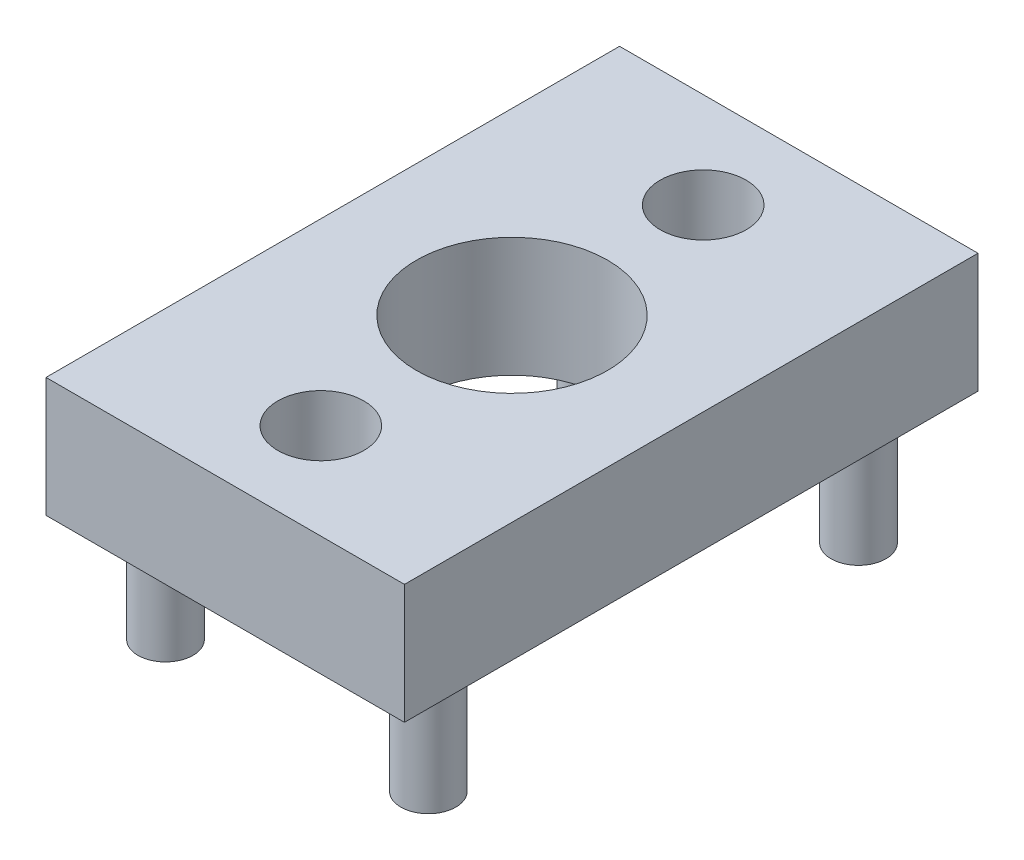
ISO-10303-21;
HEADER;
FILE_DESCRIPTION(('STEP AP214'),'2;1');
FILE_NAME('part.step','',(''),(''),'','','');
FILE_SCHEMA(('AUTOMOTIVE_DESIGN { 1 0 10303 214 1 1 1 1 }'));
ENDSEC;
DATA;
#1=APPLICATION_CONTEXT('core data for automotive mechanical design processes');
#2=APPLICATION_PROTOCOL_DEFINITION('international standard','automotive_design',2000,#1);
#3=PRODUCT_CONTEXT('',#1,'mechanical');
#4=PRODUCT('Part','Part','',(#3));
#5=PRODUCT_RELATED_PRODUCT_CATEGORY('part','',(#4));
#6=PRODUCT_DEFINITION_FORMATION('','',#4);
#7=PRODUCT_DEFINITION_CONTEXT('part definition',#1,'design');
#8=PRODUCT_DEFINITION('design','',#6,#7);
#9=PRODUCT_DEFINITION_SHAPE('','',#8);
#10=(LENGTH_UNIT() NAMED_UNIT(*) SI_UNIT(.MILLI.,.METRE.));
#11=(NAMED_UNIT(*) PLANE_ANGLE_UNIT() SI_UNIT($,.RADIAN.));
#12=(NAMED_UNIT(*) SI_UNIT($,.STERADIAN.) SOLID_ANGLE_UNIT());
#13=UNCERTAINTY_MEASURE_WITH_UNIT(LENGTH_MEASURE(1.E-05),#10,'distance_accuracy_value','');
#14=(GEOMETRIC_REPRESENTATION_CONTEXT(3) GLOBAL_UNCERTAINTY_ASSIGNED_CONTEXT((#13)) GLOBAL_UNIT_ASSIGNED_CONTEXT((#10,
#11,#12)) REPRESENTATION_CONTEXT('',''));
#15=CARTESIAN_POINT('',(0.,0.,0.));
#16=DIRECTION('',(0.,0.,1.));
#17=DIRECTION('',(1.,0.,0.));
#18=AXIS2_PLACEMENT_3D('',#15,#16,#17);
#19=CARTESIAN_POINT('',(15.,-2.5,12.));
#20=DIRECTION('',(0.,0.,-1.));
#21=DIRECTION('',(-1.,0.,0.));
#22=AXIS2_PLACEMENT_3D('',#19,#20,#21);
#23=PLANE('',#22);
#24=DIRECTION('',(0.,-1.,0.));
#25=VECTOR('',#24,1.);
#26=CARTESIAN_POINT('',(0.,-2.5,12.));
#27=LINE('',#26,#25);
#28=CARTESIAN_POINT('',(0.,2.5,12.));
#29=VERTEX_POINT('',#28);
#30=CARTESIAN_POINT('',(0.,-2.5,12.));
#31=VERTEX_POINT('',#30);
#32=EDGE_CURVE('E104',#29,#31,#27,.T.);
#33=ORIENTED_EDGE('',*,*,#32,.T.);
#34=DIRECTION('',(-1.,0.,0.));
#35=VECTOR('',#34,1.);
#36=CARTESIAN_POINT('',(15.,-2.5,12.));
#37=LINE('',#36,#35);
#38=CARTESIAN_POINT('',(15.,-2.5,12.));
#39=VERTEX_POINT('',#38);
#40=EDGE_CURVE('E95',#39,#31,#37,.T.);
#41=ORIENTED_EDGE('',*,*,#40,.F.);
#42=DIRECTION('',(0.,-1.,0.));
#43=VECTOR('',#42,1.);
#44=CARTESIAN_POINT('',(15.,-2.5,12.));
#45=LINE('',#44,#43);
#46=CARTESIAN_POINT('',(15.,2.5,12.));
#47=VERTEX_POINT('',#46);
#48=EDGE_CURVE('E89',#47,#39,#45,.T.);
#49=ORIENTED_EDGE('',*,*,#48,.F.);
#50=DIRECTION('',(-1.,0.,0.));
#51=VECTOR('',#50,1.);
#52=CARTESIAN_POINT('',(15.,2.5,12.));
#53=LINE('',#52,#51);
#54=EDGE_CURVE('E100',#47,#29,#53,.T.);
#55=ORIENTED_EDGE('',*,*,#54,.T.);
#56=EDGE_LOOP('',(#33,#41,#49,#55));
#57=FACE_BOUND('',#56,.T.);
#58=ADVANCED_FACE('F37',(#57),#23,.F.);
#59=CARTESIAN_POINT('',(15.,-2.5,-12.));
#60=DIRECTION('',(0.,1.,0.));
#61=DIRECTION('',(0.,0.,1.));
#62=AXIS2_PLACEMENT_3D('',#59,#60,#61);
#63=PLANE('',#62);
#64=CARTESIAN_POINT('',(7.5,-2.5,-8.));
#65=DIRECTION('',(0.,-1.,0.));
#66=DIRECTION('',(0.,0.,-1.));
#67=AXIS2_PLACEMENT_3D('',#64,#65,#66);
#68=CIRCLE('',#67,3.5);
#69=CARTESIAN_POINT('',(7.5,-2.5,-11.5));
#70=VERTEX_POINT('',#69);
#71=EDGE_CURVE('E253',#70,#70,#68,.T.);
#72=ORIENTED_EDGE('',*,*,#71,.F.);
#73=EDGE_LOOP('',(#72));
#74=FACE_BOUND('',#73,.T.);
#75=CARTESIAN_POINT('',(7.5,-2.5,8.));
#76=DIRECTION('',(0.,-1.,0.));
#77=DIRECTION('',(0.,0.,-1.));
#78=AXIS2_PLACEMENT_3D('',#75,#76,#77);
#79=CIRCLE('',#78,3.5);
#80=CARTESIAN_POINT('',(7.5,-2.5,4.5));
#81=VERTEX_POINT('',#80);
#82=EDGE_CURVE('E261',#81,#81,#79,.T.);
#83=ORIENTED_EDGE('',*,*,#82,.F.);
#84=EDGE_LOOP('',(#83));
#85=FACE_BOUND('',#84,.T.);
#86=CARTESIAN_POINT('',(7.5,-2.5,0.));
#87=DIRECTION('',(0.,1.,0.));
#88=DIRECTION('',(0.,0.,1.));
#89=AXIS2_PLACEMENT_3D('',#86,#87,#88);
#90=CIRCLE('',#89,4.);
#91=CARTESIAN_POINT('',(7.5,-2.5,4.));
#92=VERTEX_POINT('',#91);
#93=EDGE_CURVE('E174',#92,#92,#90,.T.);
#94=ORIENTED_EDGE('',*,*,#93,.T.);
#95=EDGE_LOOP('',(#94));
#96=FACE_BOUND('',#95,.T.);
#97=CARTESIAN_POINT('',(2.,-2.5,-9.));
#98=DIRECTION('',(0.,1.,0.));
#99=DIRECTION('',(0.,0.,1.));
#100=AXIS2_PLACEMENT_3D('',#97,#98,#99);
#101=CIRCLE('',#100,1.15);
#102=CARTESIAN_POINT('',(2.,-2.5,-7.85));
#103=VERTEX_POINT('',#102);
#104=EDGE_CURVE('E11',#103,#103,#101,.F.);
#105=ORIENTED_EDGE('',*,*,#104,.F.);
#106=EDGE_LOOP('',(#105));
#107=FACE_BOUND('',#106,.T.);
#108=CARTESIAN_POINT('',(13.,-2.5,-9.));
#109=DIRECTION('',(0.,1.,0.));
#110=DIRECTION('',(0.,0.,1.));
#111=AXIS2_PLACEMENT_3D('',#108,#109,#110);
#112=CIRCLE('',#111,1.15);
#113=CARTESIAN_POINT('',(13.,-2.5,-7.85));
#114=VERTEX_POINT('',#113);
#115=EDGE_CURVE('E45',#114,#114,#112,.F.);
#116=ORIENTED_EDGE('',*,*,#115,.F.);
#117=EDGE_LOOP('',(#116));
#118=FACE_BOUND('',#117,.T.);
#119=CARTESIAN_POINT('',(2.,-2.5,9.));
#120=DIRECTION('',(0.,1.,0.));
#121=DIRECTION('',(0.,0.,1.));
#122=AXIS2_PLACEMENT_3D('',#119,#120,#121);
#123=CIRCLE('',#122,1.15);
#124=CARTESIAN_POINT('',(2.,-2.5,10.15));
#125=VERTEX_POINT('',#124);
#126=EDGE_CURVE('E117',#125,#125,#123,.F.);
#127=ORIENTED_EDGE('',*,*,#126,.F.);
#128=EDGE_LOOP('',(#127));
#129=FACE_BOUND('',#128,.T.);
#130=CARTESIAN_POINT('',(13.,-2.5,9.));
#131=DIRECTION('',(0.,1.,0.));
#132=DIRECTION('',(0.,0.,1.));
#133=AXIS2_PLACEMENT_3D('',#130,#131,#132);
#134=CIRCLE('',#133,1.15);
#135=CARTESIAN_POINT('',(13.,-2.5,10.15));
#136=VERTEX_POINT('',#135);
#137=EDGE_CURVE('E114',#136,#136,#134,.F.);
#138=ORIENTED_EDGE('',*,*,#137,.F.);
#139=EDGE_LOOP('',(#138));
#140=FACE_BOUND('',#139,.T.);
#141=DIRECTION('',(0.,0.,-1.));
#142=VECTOR('',#141,1.);
#143=CARTESIAN_POINT('',(0.,-2.5,-12.));
#144=LINE('',#143,#142);
#145=CARTESIAN_POINT('',(0.,-2.5,-12.));
#146=VERTEX_POINT('',#145);
#147=EDGE_CURVE('E94',#31,#146,#144,.T.);
#148=ORIENTED_EDGE('',*,*,#147,.T.);
#149=DIRECTION('',(-1.,0.,0.));
#150=VECTOR('',#149,1.);
#151=CARTESIAN_POINT('',(15.,-2.5,-12.));
#152=LINE('',#151,#150);
#153=CARTESIAN_POINT('',(15.,-2.5,-12.));
#154=VERTEX_POINT('',#153);
#155=EDGE_CURVE('E92',#154,#146,#152,.T.);
#156=ORIENTED_EDGE('',*,*,#155,.F.);
#157=DIRECTION('',(0.,0.,-1.));
#158=VECTOR('',#157,1.);
#159=CARTESIAN_POINT('',(15.,-2.5,-12.));
#160=LINE('',#159,#158);
#161=EDGE_CURVE('E84',#39,#154,#160,.T.);
#162=ORIENTED_EDGE('',*,*,#161,.F.);
#163=ORIENTED_EDGE('',*,*,#40,.T.);
#164=EDGE_LOOP('',(#148,#156,#162,#163));
#165=FACE_BOUND('',#164,.T.);
#166=ADVANCED_FACE('F93',(#74,#85,#96,#107,#118,#129,#140,#165),#63,.F.);
#167=CARTESIAN_POINT('',(15.,-2.5,-12.));
#168=DIRECTION('',(0.,0.,1.));
#169=DIRECTION('',(1.,0.,0.));
#170=AXIS2_PLACEMENT_3D('',#167,#168,#169);
#171=PLANE('',#170);
#172=DIRECTION('',(0.,1.,0.));
#173=VECTOR('',#172,1.);
#174=CARTESIAN_POINT('',(0.,-2.5,-12.));
#175=LINE('',#174,#173);
#176=CARTESIAN_POINT('',(0.,2.5,-12.));
#177=VERTEX_POINT('',#176);
#178=EDGE_CURVE('E70',#146,#177,#175,.T.);
#179=ORIENTED_EDGE('',*,*,#178,.T.);
#180=DIRECTION('',(-1.,0.,0.));
#181=VECTOR('',#180,1.);
#182=CARTESIAN_POINT('',(15.,2.5,-12.));
#183=LINE('',#182,#181);
#184=CARTESIAN_POINT('',(15.,2.5,-12.));
#185=VERTEX_POINT('',#184);
#186=EDGE_CURVE('E96',#185,#177,#183,.T.);
#187=ORIENTED_EDGE('',*,*,#186,.F.);
#188=DIRECTION('',(0.,1.,0.));
#189=VECTOR('',#188,1.);
#190=CARTESIAN_POINT('',(15.,-2.5,-12.));
#191=LINE('',#190,#189);
#192=EDGE_CURVE('E87',#154,#185,#191,.T.);
#193=ORIENTED_EDGE('',*,*,#192,.F.);
#194=ORIENTED_EDGE('',*,*,#155,.T.);
#195=EDGE_LOOP('',(#179,#187,#193,#194));
#196=FACE_BOUND('',#195,.T.);
#197=ADVANCED_FACE('F98',(#196),#171,.F.);
#198=CARTESIAN_POINT('',(15.,2.5,-12.));
#199=DIRECTION('',(0.,-1.,0.));
#200=DIRECTION('',(0.,0.,-1.));
#201=AXIS2_PLACEMENT_3D('',#198,#199,#200);
#202=PLANE('',#201);
#203=CARTESIAN_POINT('',(7.5,2.5,-8.));
#204=DIRECTION('',(0.,-1.,0.));
#205=DIRECTION('',(0.,0.,-1.));
#206=AXIS2_PLACEMENT_3D('',#203,#204,#205);
#207=CIRCLE('',#206,1.8);
#208=CARTESIAN_POINT('',(7.5,2.5,-9.8));
#209=VERTEX_POINT('',#208);
#210=EDGE_CURVE('E165',#209,#209,#207,.T.);
#211=ORIENTED_EDGE('',*,*,#210,.T.);
#212=EDGE_LOOP('',(#211));
#213=FACE_BOUND('',#212,.T.);
#214=CARTESIAN_POINT('',(7.5,2.5,8.));
#215=DIRECTION('',(0.,-1.,0.));
#216=DIRECTION('',(0.,0.,-1.));
#217=AXIS2_PLACEMENT_3D('',#214,#215,#216);
#218=CIRCLE('',#217,1.8);
#219=CARTESIAN_POINT('',(7.5,2.5,6.2));
#220=VERTEX_POINT('',#219);
#221=EDGE_CURVE('E169',#220,#220,#218,.T.);
#222=ORIENTED_EDGE('',*,*,#221,.T.);
#223=EDGE_LOOP('',(#222));
#224=FACE_BOUND('',#223,.T.);
#225=CARTESIAN_POINT('',(7.5,2.5,0.));
#226=DIRECTION('',(0.,1.,0.));
#227=DIRECTION('',(0.,0.,1.));
#228=AXIS2_PLACEMENT_3D('',#225,#226,#227);
#229=CIRCLE('',#228,4.);
#230=CARTESIAN_POINT('',(7.5,2.5,4.));
#231=VERTEX_POINT('',#230);
#232=EDGE_CURVE('E172',#231,#231,#229,.T.);
#233=ORIENTED_EDGE('',*,*,#232,.F.);
#234=EDGE_LOOP('',(#233));
#235=FACE_BOUND('',#234,.T.);
#236=DIRECTION('',(0.,0.,1.));
#237=VECTOR('',#236,1.);
#238=CARTESIAN_POINT('',(0.,2.5,-12.));
#239=LINE('',#238,#237);
#240=EDGE_CURVE('E76',#177,#29,#239,.T.);
#241=ORIENTED_EDGE('',*,*,#240,.T.);
#242=ORIENTED_EDGE('',*,*,#54,.F.);
#243=DIRECTION('',(0.,0.,1.));
#244=VECTOR('',#243,1.);
#245=CARTESIAN_POINT('',(15.,2.5,-12.));
#246=LINE('',#245,#244);
#247=EDGE_CURVE('E53',#185,#47,#246,.T.);
#248=ORIENTED_EDGE('',*,*,#247,.F.);
#249=ORIENTED_EDGE('',*,*,#186,.T.);
#250=EDGE_LOOP('',(#241,#242,#248,#249));
#251=FACE_BOUND('',#250,.T.);
#252=ADVANCED_FACE('F153',(#213,#224,#235,#251),#202,.F.);
#253=CARTESIAN_POINT('',(15.,0.,0.));
#254=DIRECTION('',(1.,0.,0.));
#255=DIRECTION('',(0.,0.,-1.));
#256=AXIS2_PLACEMENT_3D('',#253,#254,#255);
#257=PLANE('',#256);
#258=ORIENTED_EDGE('',*,*,#48,.T.);
#259=ORIENTED_EDGE('',*,*,#161,.T.);
#260=ORIENTED_EDGE('',*,*,#192,.T.);
#261=ORIENTED_EDGE('',*,*,#247,.T.);
#262=EDGE_LOOP('',(#258,#259,#260,#261));
#263=FACE_BOUND('',#262,.T.);
#264=ADVANCED_FACE('F85',(#263),#257,.T.);
#265=CARTESIAN_POINT('',(0.,0.,0.));
#266=DIRECTION('',(1.,0.,0.));
#267=DIRECTION('',(0.,0.,-1.));
#268=AXIS2_PLACEMENT_3D('',#265,#266,#267);
#269=PLANE('',#268);
#270=ORIENTED_EDGE('',*,*,#32,.F.);
#271=ORIENTED_EDGE('',*,*,#240,.F.);
#272=ORIENTED_EDGE('',*,*,#178,.F.);
#273=ORIENTED_EDGE('',*,*,#147,.F.);
#274=EDGE_LOOP('',(#270,#271,#272,#273));
#275=FACE_BOUND('',#274,.T.);
#276=ADVANCED_FACE('F134',(#275),#269,.F.);
#277=CARTESIAN_POINT('',(13.,-7.5,9.));
#278=DIRECTION('',(0.,1.,0.));
#279=DIRECTION('',(0.,0.,1.));
#280=AXIS2_PLACEMENT_3D('',#277,#278,#279);
#281=CYLINDRICAL_SURFACE('',#280,1.15);
#282=CARTESIAN_POINT('',(13.,-7.5,9.));
#283=DIRECTION('',(0.,-1.,0.));
#284=DIRECTION('',(0.,0.,-1.));
#285=AXIS2_PLACEMENT_3D('',#282,#283,#284);
#286=CIRCLE('',#285,1.15);
#287=CARTESIAN_POINT('',(13.,-7.5,7.85));
#288=VERTEX_POINT('',#287);
#289=EDGE_CURVE('E107',#288,#288,#286,.T.);
#290=ORIENTED_EDGE('',*,*,#289,.F.);
#291=EDGE_LOOP('',(#290));
#292=FACE_BOUND('',#291,.T.);
#293=ORIENTED_EDGE('',*,*,#137,.T.);
#294=EDGE_LOOP('',(#293));
#295=FACE_BOUND('',#294,.T.);
#296=ADVANCED_FACE('F131',(#292,#295),#281,.T.);
#297=CARTESIAN_POINT('',(13.,-7.5,9.));
#298=DIRECTION('',(0.,-1.,0.));
#299=DIRECTION('',(0.,0.,-1.));
#300=AXIS2_PLACEMENT_3D('',#297,#298,#299);
#301=PLANE('',#300);
#302=ORIENTED_EDGE('',*,*,#289,.T.);
#303=EDGE_LOOP('',(#302));
#304=FACE_BOUND('',#303,.T.);
#305=ADVANCED_FACE('F133',(#304),#301,.T.);
#306=CARTESIAN_POINT('',(2.,-7.5,9.));
#307=DIRECTION('',(0.,1.,0.));
#308=DIRECTION('',(0.,0.,1.));
#309=AXIS2_PLACEMENT_3D('',#306,#307,#308);
#310=CYLINDRICAL_SURFACE('',#309,1.15);
#311=CARTESIAN_POINT('',(2.,-7.5,9.));
#312=DIRECTION('',(0.,-1.,0.));
#313=DIRECTION('',(0.,0.,-1.));
#314=AXIS2_PLACEMENT_3D('',#311,#312,#313);
#315=CIRCLE('',#314,1.15);
#316=CARTESIAN_POINT('',(2.,-7.5,7.85));
#317=VERTEX_POINT('',#316);
#318=EDGE_CURVE('E188',#317,#317,#315,.T.);
#319=ORIENTED_EDGE('',*,*,#318,.F.);
#320=EDGE_LOOP('',(#319));
#321=FACE_BOUND('',#320,.T.);
#322=ORIENTED_EDGE('',*,*,#126,.T.);
#323=EDGE_LOOP('',(#322));
#324=FACE_BOUND('',#323,.T.);
#325=ADVANCED_FACE('F141',(#321,#324),#310,.T.);
#326=CARTESIAN_POINT('',(2.,-7.5,9.));
#327=DIRECTION('',(0.,-1.,0.));
#328=DIRECTION('',(0.,0.,-1.));
#329=AXIS2_PLACEMENT_3D('',#326,#327,#328);
#330=PLANE('',#329);
#331=ORIENTED_EDGE('',*,*,#318,.T.);
#332=EDGE_LOOP('',(#331));
#333=FACE_BOUND('',#332,.T.);
#334=ADVANCED_FACE('F194',(#333),#330,.T.);
#335=CARTESIAN_POINT('',(13.,-7.5,-9.));
#336=DIRECTION('',(0.,1.,0.));
#337=DIRECTION('',(0.,0.,1.));
#338=AXIS2_PLACEMENT_3D('',#335,#336,#337);
#339=CYLINDRICAL_SURFACE('',#338,1.15);
#340=CARTESIAN_POINT('',(13.,-7.5,-9.));
#341=DIRECTION('',(0.,-1.,0.));
#342=DIRECTION('',(0.,0.,-1.));
#343=AXIS2_PLACEMENT_3D('',#340,#341,#342);
#344=CIRCLE('',#343,1.15);
#345=CARTESIAN_POINT('',(13.,-7.5,-10.15));
#346=VERTEX_POINT('',#345);
#347=EDGE_CURVE('E185',#346,#346,#344,.T.);
#348=ORIENTED_EDGE('',*,*,#347,.F.);
#349=EDGE_LOOP('',(#348));
#350=FACE_BOUND('',#349,.T.);
#351=ORIENTED_EDGE('',*,*,#115,.T.);
#352=EDGE_LOOP('',(#351));
#353=FACE_BOUND('',#352,.T.);
#354=ADVANCED_FACE('F122',(#350,#353),#339,.T.);
#355=CARTESIAN_POINT('',(13.,-7.5,-9.));
#356=DIRECTION('',(0.,-1.,0.));
#357=DIRECTION('',(0.,0.,-1.));
#358=AXIS2_PLACEMENT_3D('',#355,#356,#357);
#359=PLANE('',#358);
#360=ORIENTED_EDGE('',*,*,#347,.T.);
#361=EDGE_LOOP('',(#360));
#362=FACE_BOUND('',#361,.T.);
#363=ADVANCED_FACE('F204',(#362),#359,.T.);
#364=CARTESIAN_POINT('',(2.,-7.5,-9.));
#365=DIRECTION('',(0.,1.,0.));
#366=DIRECTION('',(0.,0.,1.));
#367=AXIS2_PLACEMENT_3D('',#364,#365,#366);
#368=CYLINDRICAL_SURFACE('',#367,1.15);
#369=CARTESIAN_POINT('',(2.,-7.5,-9.));
#370=DIRECTION('',(0.,-1.,0.));
#371=DIRECTION('',(0.,0.,-1.));
#372=AXIS2_PLACEMENT_3D('',#369,#370,#371);
#373=CIRCLE('',#372,1.15);
#374=CARTESIAN_POINT('',(2.,-7.5,-10.15));
#375=VERTEX_POINT('',#374);
#376=EDGE_CURVE('E177',#375,#375,#373,.T.);
#377=ORIENTED_EDGE('',*,*,#376,.F.);
#378=EDGE_LOOP('',(#377));
#379=FACE_BOUND('',#378,.T.);
#380=ORIENTED_EDGE('',*,*,#104,.T.);
#381=EDGE_LOOP('',(#380));
#382=FACE_BOUND('',#381,.T.);
#383=ADVANCED_FACE('F207',(#379,#382),#368,.T.);
#384=CARTESIAN_POINT('',(2.,-7.5,-9.));
#385=DIRECTION('',(0.,-1.,0.));
#386=DIRECTION('',(0.,0.,-1.));
#387=AXIS2_PLACEMENT_3D('',#384,#385,#386);
#388=PLANE('',#387);
#389=ORIENTED_EDGE('',*,*,#376,.T.);
#390=EDGE_LOOP('',(#389));
#391=FACE_BOUND('',#390,.T.);
#392=ADVANCED_FACE('F212',(#391),#388,.T.);
#393=CARTESIAN_POINT('',(7.5,-7.5,0.));
#394=DIRECTION('',(0.,1.,0.));
#395=DIRECTION('',(0.,0.,1.));
#396=AXIS2_PLACEMENT_3D('',#393,#394,#395);
#397=CYLINDRICAL_SURFACE('',#396,4.);
#398=ORIENTED_EDGE('',*,*,#232,.T.);
#399=EDGE_LOOP('',(#398));
#400=FACE_BOUND('',#399,.T.);
#401=ORIENTED_EDGE('',*,*,#93,.F.);
#402=EDGE_LOOP('',(#401));
#403=FACE_BOUND('',#402,.T.);
#404=ADVANCED_FACE('F215',(#400,#403),#397,.F.);
#405=CARTESIAN_POINT('',(7.5,-2.5,8.));
#406=DIRECTION('',(0.,-1.,0.));
#407=DIRECTION('',(0.,0.,-1.));
#408=AXIS2_PLACEMENT_3D('',#405,#406,#407);
#409=CYLINDRICAL_SURFACE('',#408,1.8);
#410=ORIENTED_EDGE('',*,*,#221,.F.);
#411=EDGE_LOOP('',(#410));
#412=FACE_BOUND('',#411,.T.);
#413=CARTESIAN_POINT('',(7.5,-0.100000000000001,8.));
#414=DIRECTION('',(0.,-1.,0.));
#415=DIRECTION('',(0.,0.,-1.));
#416=AXIS2_PLACEMENT_3D('',#413,#414,#415);
#417=CIRCLE('',#416,1.8);
#418=CARTESIAN_POINT('',(7.5,-0.100000000000001,6.2));
#419=VERTEX_POINT('',#418);
#420=EDGE_CURVE('E179',#419,#419,#417,.T.);
#421=ORIENTED_EDGE('',*,*,#420,.T.);
#422=EDGE_LOOP('',(#421));
#423=FACE_BOUND('',#422,.T.);
#424=ADVANCED_FACE('F222',(#412,#423),#409,.F.);
#425=CARTESIAN_POINT('',(9.3,-0.100000000000001,8.));
#426=DIRECTION('',(0.,1.,0.));
#427=DIRECTION('',(0.,0.,1.));
#428=AXIS2_PLACEMENT_3D('',#425,#426,#427);
#429=PLANE('',#428);
#430=ORIENTED_EDGE('',*,*,#420,.F.);
#431=EDGE_LOOP('',(#430));
#432=FACE_BOUND('',#431,.T.);
#433=CARTESIAN_POINT('',(7.5,-0.100000000000001,8.));
#434=DIRECTION('',(0.,-1.,0.));
#435=DIRECTION('',(0.,0.,-1.));
#436=AXIS2_PLACEMENT_3D('',#433,#434,#435);
#437=CIRCLE('',#436,3.5);
#438=CARTESIAN_POINT('',(7.5,-0.100000000000001,4.5));
#439=VERTEX_POINT('',#438);
#440=EDGE_CURVE('E264',#439,#439,#437,.T.);
#441=ORIENTED_EDGE('',*,*,#440,.T.);
#442=EDGE_LOOP('',(#441));
#443=FACE_BOUND('',#442,.T.);
#444=ADVANCED_FACE('F225',(#432,#443),#429,.F.);
#445=CARTESIAN_POINT('',(7.5,-2.5,8.));
#446=DIRECTION('',(0.,-1.,0.));
#447=DIRECTION('',(0.,0.,-1.));
#448=AXIS2_PLACEMENT_3D('',#445,#446,#447);
#449=CYLINDRICAL_SURFACE('',#448,3.5);
#450=ORIENTED_EDGE('',*,*,#440,.F.);
#451=EDGE_LOOP('',(#450));
#452=FACE_BOUND('',#451,.T.);
#453=ORIENTED_EDGE('',*,*,#82,.T.);
#454=EDGE_LOOP('',(#453));
#455=FACE_BOUND('',#454,.T.);
#456=ADVANCED_FACE('F229',(#452,#455),#449,.F.);
#457=CARTESIAN_POINT('',(7.5,-2.5,-8.));
#458=DIRECTION('',(0.,-1.,0.));
#459=DIRECTION('',(0.,0.,-1.));
#460=AXIS2_PLACEMENT_3D('',#457,#458,#459);
#461=CYLINDRICAL_SURFACE('',#460,1.8);
#462=ORIENTED_EDGE('',*,*,#210,.F.);
#463=EDGE_LOOP('',(#462));
#464=FACE_BOUND('',#463,.T.);
#465=CARTESIAN_POINT('',(7.5,-0.0999999999999994,-8.));
#466=DIRECTION('',(0.,-1.,0.));
#467=DIRECTION('',(0.,0.,-1.));
#468=AXIS2_PLACEMENT_3D('',#465,#466,#467);
#469=CIRCLE('',#468,1.8);
#470=CARTESIAN_POINT('',(7.5,-0.0999999999999994,-9.8));
#471=VERTEX_POINT('',#470);
#472=EDGE_CURVE('E255',#471,#471,#469,.T.);
#473=ORIENTED_EDGE('',*,*,#472,.T.);
#474=EDGE_LOOP('',(#473));
#475=FACE_BOUND('',#474,.T.);
#476=ADVANCED_FACE('F233',(#464,#475),#461,.F.);
#477=CARTESIAN_POINT('',(9.3,-0.0999999999999994,-8.));
#478=DIRECTION('',(0.,1.,0.));
#479=DIRECTION('',(0.,0.,1.));
#480=AXIS2_PLACEMENT_3D('',#477,#478,#479);
#481=PLANE('',#480);
#482=ORIENTED_EDGE('',*,*,#472,.F.);
#483=EDGE_LOOP('',(#482));
#484=FACE_BOUND('',#483,.T.);
#485=CARTESIAN_POINT('',(7.5,-0.0999999999999994,-8.));
#486=DIRECTION('',(0.,-1.,0.));
#487=DIRECTION('',(0.,0.,-1.));
#488=AXIS2_PLACEMENT_3D('',#485,#486,#487);
#489=CIRCLE('',#488,3.5);
#490=CARTESIAN_POINT('',(7.5,-0.0999999999999994,-11.5));
#491=VERTEX_POINT('',#490);
#492=EDGE_CURVE('E250',#491,#491,#489,.T.);
#493=ORIENTED_EDGE('',*,*,#492,.T.);
#494=EDGE_LOOP('',(#493));
#495=FACE_BOUND('',#494,.T.);
#496=ADVANCED_FACE('F237',(#484,#495),#481,.F.);
#497=CARTESIAN_POINT('',(7.5,-2.5,-8.));
#498=DIRECTION('',(0.,-1.,0.));
#499=DIRECTION('',(0.,0.,-1.));
#500=AXIS2_PLACEMENT_3D('',#497,#498,#499);
#501=CYLINDRICAL_SURFACE('',#500,3.5);
#502=ORIENTED_EDGE('',*,*,#492,.F.);
#503=EDGE_LOOP('',(#502));
#504=FACE_BOUND('',#503,.T.);
#505=ORIENTED_EDGE('',*,*,#71,.T.);
#506=EDGE_LOOP('',(#505));
#507=FACE_BOUND('',#506,.T.);
#508=ADVANCED_FACE('F241',(#504,#507),#501,.F.);
#509=CLOSED_SHELL('',(#58,#166,#197,#252,#264,#276,#296,#305,#325,#334,#354,#363,#383,#392,#404,
#424,#444,#456,#476,#496,#508));
#510=MANIFOLD_SOLID_BREP('B2',#509);
#511=ADVANCED_BREP_SHAPE_REPRESENTATION('',(#18,#510),#14);
#512=SHAPE_DEFINITION_REPRESENTATION(#9,#511);
ENDSEC;
END-ISO-10303-21;
